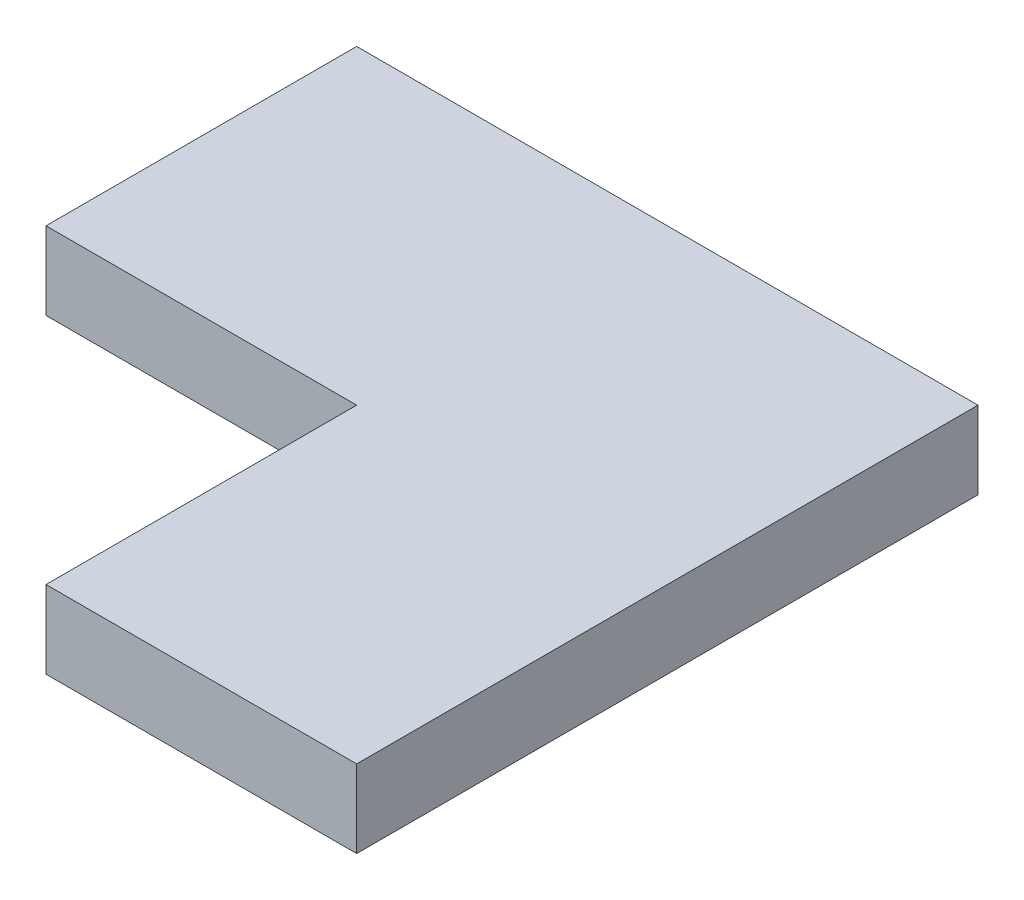
ISO-10303-21;
HEADER;
FILE_DESCRIPTION(('STEP AP214'),'2;1');
FILE_NAME('part.step','',(''),(''),'','','');
FILE_SCHEMA(('AUTOMOTIVE_DESIGN { 1 0 10303 214 1 1 1 1 }'));
ENDSEC;
DATA;
#1=APPLICATION_CONTEXT('core data for automotive mechanical design processes');
#2=APPLICATION_PROTOCOL_DEFINITION('international standard','automotive_design',2000,#1);
#3=PRODUCT_CONTEXT('',#1,'mechanical');
#4=PRODUCT('Part','Part','',(#3));
#5=PRODUCT_RELATED_PRODUCT_CATEGORY('part','',(#4));
#6=PRODUCT_DEFINITION_FORMATION('','',#4);
#7=PRODUCT_DEFINITION_CONTEXT('part definition',#1,'design');
#8=PRODUCT_DEFINITION('design','',#6,#7);
#9=PRODUCT_DEFINITION_SHAPE('','',#8);
#10=(LENGTH_UNIT() NAMED_UNIT(*) SI_UNIT(.MILLI.,.METRE.));
#11=(NAMED_UNIT(*) PLANE_ANGLE_UNIT() SI_UNIT($,.RADIAN.));
#12=(NAMED_UNIT(*) SI_UNIT($,.STERADIAN.) SOLID_ANGLE_UNIT());
#13=UNCERTAINTY_MEASURE_WITH_UNIT(LENGTH_MEASURE(1.E-05),#10,'distance_accuracy_value','');
#14=(GEOMETRIC_REPRESENTATION_CONTEXT(3) GLOBAL_UNCERTAINTY_ASSIGNED_CONTEXT((#13)) GLOBAL_UNIT_ASSIGNED_CONTEXT((#10,
#11,#12)) REPRESENTATION_CONTEXT('',''));
#15=CARTESIAN_POINT('',(0.,0.,0.));
#16=DIRECTION('',(0.,0.,1.));
#17=DIRECTION('',(1.,0.,0.));
#18=AXIS2_PLACEMENT_3D('',#15,#16,#17);
#19=CARTESIAN_POINT('',(100.,25.,0.));
#20=DIRECTION('',(1.,0.,0.));
#21=DIRECTION('',(0.,0.,-1.));
#22=AXIS2_PLACEMENT_3D('',#19,#20,#21);
#23=PLANE('',#22);
#24=DIRECTION('',(0.,0.,1.));
#25=VECTOR('',#24,1.);
#26=CARTESIAN_POINT('',(100.,0.,0.));
#27=LINE('',#26,#25);
#28=CARTESIAN_POINT('',(100.,0.,-50.));
#29=VERTEX_POINT('',#28);
#30=CARTESIAN_POINT('',(100.,0.,150.));
#31=VERTEX_POINT('',#30);
#32=EDGE_CURVE('E114',#29,#31,#27,.T.);
#33=ORIENTED_EDGE('',*,*,#32,.F.);
#34=DIRECTION('',(0.,-1.,0.));
#35=VECTOR('',#34,1.);
#36=CARTESIAN_POINT('',(100.,25.,-50.));
#37=LINE('',#36,#35);
#38=CARTESIAN_POINT('',(100.,25.,-50.));
#39=VERTEX_POINT('',#38);
#40=EDGE_CURVE('E11',#39,#29,#37,.T.);
#41=ORIENTED_EDGE('',*,*,#40,.F.);
#42=DIRECTION('',(0.,0.,1.));
#43=VECTOR('',#42,1.);
#44=CARTESIAN_POINT('',(100.,25.,0.));
#45=LINE('',#44,#43);
#46=CARTESIAN_POINT('',(100.,25.,150.));
#47=VERTEX_POINT('',#46);
#48=EDGE_CURVE('E126',#39,#47,#45,.T.);
#49=ORIENTED_EDGE('',*,*,#48,.T.);
#50=DIRECTION('',(0.,-1.,0.));
#51=VECTOR('',#50,1.);
#52=CARTESIAN_POINT('',(100.,25.,150.));
#53=LINE('',#52,#51);
#54=EDGE_CURVE('E78',#47,#31,#53,.T.);
#55=ORIENTED_EDGE('',*,*,#54,.T.);
#56=EDGE_LOOP('',(#33,#41,#49,#55));
#57=FACE_BOUND('',#56,.T.);
#58=ADVANCED_FACE('F33',(#57),#23,.T.);
#59=CARTESIAN_POINT('',(0.,25.,-50.));
#60=DIRECTION('',(0.,0.,-1.));
#61=DIRECTION('',(-1.,0.,0.));
#62=AXIS2_PLACEMENT_3D('',#59,#60,#61);
#63=PLANE('',#62);
#64=DIRECTION('',(1.,0.,0.));
#65=VECTOR('',#64,1.);
#66=CARTESIAN_POINT('',(0.,0.,-50.));
#67=LINE('',#66,#65);
#68=CARTESIAN_POINT('',(-100.,0.,-50.));
#69=VERTEX_POINT('',#68);
#70=EDGE_CURVE('E117',#69,#29,#67,.T.);
#71=ORIENTED_EDGE('',*,*,#70,.F.);
#72=DIRECTION('',(0.,-1.,0.));
#73=VECTOR('',#72,1.);
#74=CARTESIAN_POINT('',(-100.,25.,-50.));
#75=LINE('',#74,#73);
#76=CARTESIAN_POINT('',(-100.,25.,-50.));
#77=VERTEX_POINT('',#76);
#78=EDGE_CURVE('E41',#77,#69,#75,.T.);
#79=ORIENTED_EDGE('',*,*,#78,.F.);
#80=DIRECTION('',(1.,0.,0.));
#81=VECTOR('',#80,1.);
#82=CARTESIAN_POINT('',(0.,25.,-50.));
#83=LINE('',#82,#81);
#84=EDGE_CURVE('E138',#77,#39,#83,.T.);
#85=ORIENTED_EDGE('',*,*,#84,.T.);
#86=ORIENTED_EDGE('',*,*,#40,.T.);
#87=EDGE_LOOP('',(#71,#79,#85,#86));
#88=FACE_BOUND('',#87,.T.);
#89=ADVANCED_FACE('F137',(#88),#63,.T.);
#90=CARTESIAN_POINT('',(-100.,25.,0.));
#91=DIRECTION('',(1.,0.,0.));
#92=DIRECTION('',(0.,0.,-1.));
#93=AXIS2_PLACEMENT_3D('',#90,#91,#92);
#94=PLANE('',#93);
#95=DIRECTION('',(0.,0.,1.));
#96=VECTOR('',#95,1.);
#97=CARTESIAN_POINT('',(-100.,0.,0.));
#98=LINE('',#97,#96);
#99=CARTESIAN_POINT('',(-100.,0.,50.));
#100=VERTEX_POINT('',#99);
#101=EDGE_CURVE('E120',#69,#100,#98,.T.);
#102=ORIENTED_EDGE('',*,*,#101,.T.);
#103=DIRECTION('',(0.,-1.,0.));
#104=VECTOR('',#103,1.);
#105=CARTESIAN_POINT('',(-100.,25.,50.));
#106=LINE('',#105,#104);
#107=CARTESIAN_POINT('',(-100.,25.,50.));
#108=VERTEX_POINT('',#107);
#109=EDGE_CURVE('E106',#108,#100,#106,.T.);
#110=ORIENTED_EDGE('',*,*,#109,.F.);
#111=DIRECTION('',(0.,0.,1.));
#112=VECTOR('',#111,1.);
#113=CARTESIAN_POINT('',(-100.,25.,0.));
#114=LINE('',#113,#112);
#115=EDGE_CURVE('E97',#77,#108,#114,.T.);
#116=ORIENTED_EDGE('',*,*,#115,.F.);
#117=ORIENTED_EDGE('',*,*,#78,.T.);
#118=EDGE_LOOP('',(#102,#110,#116,#117));
#119=FACE_BOUND('',#118,.T.);
#120=ADVANCED_FACE('F131',(#119),#94,.F.);
#121=CARTESIAN_POINT('',(0.,25.,50.));
#122=DIRECTION('',(0.,0.,-1.));
#123=DIRECTION('',(-1.,0.,0.));
#124=AXIS2_PLACEMENT_3D('',#121,#122,#123);
#125=PLANE('',#124);
#126=DIRECTION('',(1.,0.,0.));
#127=VECTOR('',#126,1.);
#128=CARTESIAN_POINT('',(0.,0.,50.));
#129=LINE('',#128,#127);
#130=CARTESIAN_POINT('',(0.,0.,50.));
#131=VERTEX_POINT('',#130);
#132=EDGE_CURVE('E105',#100,#131,#129,.T.);
#133=ORIENTED_EDGE('',*,*,#132,.T.);
#134=DIRECTION('',(0.,-1.,0.));
#135=VECTOR('',#134,1.);
#136=CARTESIAN_POINT('',(0.,25.,50.));
#137=LINE('',#136,#135);
#138=CARTESIAN_POINT('',(0.,25.,50.));
#139=VERTEX_POINT('',#138);
#140=EDGE_CURVE('E102',#139,#131,#137,.T.);
#141=ORIENTED_EDGE('',*,*,#140,.F.);
#142=DIRECTION('',(1.,0.,0.));
#143=VECTOR('',#142,1.);
#144=CARTESIAN_POINT('',(0.,25.,50.));
#145=LINE('',#144,#143);
#146=EDGE_CURVE('E90',#108,#139,#145,.T.);
#147=ORIENTED_EDGE('',*,*,#146,.F.);
#148=ORIENTED_EDGE('',*,*,#109,.T.);
#149=EDGE_LOOP('',(#133,#141,#147,#148));
#150=FACE_BOUND('',#149,.T.);
#151=ADVANCED_FACE('F103',(#150),#125,.F.);
#152=CARTESIAN_POINT('',(0.,25.,0.));
#153=DIRECTION('',(1.,0.,0.));
#154=DIRECTION('',(0.,0.,-1.));
#155=AXIS2_PLACEMENT_3D('',#152,#153,#154);
#156=PLANE('',#155);
#157=DIRECTION('',(0.,0.,1.));
#158=VECTOR('',#157,1.);
#159=CARTESIAN_POINT('',(0.,0.,0.));
#160=LINE('',#159,#158);
#161=CARTESIAN_POINT('',(0.,0.,150.));
#162=VERTEX_POINT('',#161);
#163=EDGE_CURVE('E71',#131,#162,#160,.T.);
#164=ORIENTED_EDGE('',*,*,#163,.T.);
#165=DIRECTION('',(0.,-1.,0.));
#166=VECTOR('',#165,1.);
#167=CARTESIAN_POINT('',(0.,25.,150.));
#168=LINE('',#167,#166);
#169=CARTESIAN_POINT('',(0.,25.,150.));
#170=VERTEX_POINT('',#169);
#171=EDGE_CURVE('E107',#170,#162,#168,.T.);
#172=ORIENTED_EDGE('',*,*,#171,.F.);
#173=DIRECTION('',(0.,0.,1.));
#174=VECTOR('',#173,1.);
#175=CARTESIAN_POINT('',(0.,25.,0.));
#176=LINE('',#175,#174);
#177=EDGE_CURVE('E94',#139,#170,#176,.T.);
#178=ORIENTED_EDGE('',*,*,#177,.F.);
#179=ORIENTED_EDGE('',*,*,#140,.T.);
#180=EDGE_LOOP('',(#164,#172,#178,#179));
#181=FACE_BOUND('',#180,.T.);
#182=ADVANCED_FACE('F109',(#181),#156,.F.);
#183=CARTESIAN_POINT('',(0.,25.,150.));
#184=DIRECTION('',(0.,0.,-1.));
#185=DIRECTION('',(-1.,0.,0.));
#186=AXIS2_PLACEMENT_3D('',#183,#184,#185);
#187=PLANE('',#186);
#188=DIRECTION('',(1.,0.,0.));
#189=VECTOR('',#188,1.);
#190=CARTESIAN_POINT('',(0.,0.,150.));
#191=LINE('',#190,#189);
#192=EDGE_CURVE('E124',#162,#31,#191,.T.);
#193=ORIENTED_EDGE('',*,*,#192,.T.);
#194=ORIENTED_EDGE('',*,*,#54,.F.);
#195=DIRECTION('',(1.,0.,0.));
#196=VECTOR('',#195,1.);
#197=CARTESIAN_POINT('',(0.,25.,150.));
#198=LINE('',#197,#196);
#199=EDGE_CURVE('E49',#170,#47,#198,.T.);
#200=ORIENTED_EDGE('',*,*,#199,.F.);
#201=ORIENTED_EDGE('',*,*,#171,.T.);
#202=EDGE_LOOP('',(#193,#194,#200,#201));
#203=FACE_BOUND('',#202,.T.);
#204=ADVANCED_FACE('F141',(#203),#187,.F.);
#205=CARTESIAN_POINT('',(0.,25.,0.));
#206=DIRECTION('',(0.,1.,0.));
#207=DIRECTION('',(0.,0.,1.));
#208=AXIS2_PLACEMENT_3D('',#205,#206,#207);
#209=PLANE('',#208);
#210=ORIENTED_EDGE('',*,*,#48,.F.);
#211=ORIENTED_EDGE('',*,*,#84,.F.);
#212=ORIENTED_EDGE('',*,*,#115,.T.);
#213=ORIENTED_EDGE('',*,*,#146,.T.);
#214=ORIENTED_EDGE('',*,*,#177,.T.);
#215=ORIENTED_EDGE('',*,*,#199,.T.);
#216=EDGE_LOOP('',(#210,#211,#212,#213,#214,#215));
#217=FACE_BOUND('',#216,.T.);
#218=ADVANCED_FACE('F92',(#217),#209,.T.);
#219=CARTESIAN_POINT('',(0.,0.,0.));
#220=DIRECTION('',(0.,1.,0.));
#221=DIRECTION('',(0.,0.,1.));
#222=AXIS2_PLACEMENT_3D('',#219,#220,#221);
#223=PLANE('',#222);
#224=ORIENTED_EDGE('',*,*,#32,.T.);
#225=ORIENTED_EDGE('',*,*,#192,.F.);
#226=ORIENTED_EDGE('',*,*,#163,.F.);
#227=ORIENTED_EDGE('',*,*,#132,.F.);
#228=ORIENTED_EDGE('',*,*,#101,.F.);
#229=ORIENTED_EDGE('',*,*,#70,.T.);
#230=EDGE_LOOP('',(#224,#225,#226,#227,#228,#229));
#231=FACE_BOUND('',#230,.T.);
#232=ADVANCED_FACE('F136',(#231),#223,.F.);
#233=CLOSED_SHELL('',(#58,#89,#120,#151,#182,#204,#218,#232));
#234=MANIFOLD_SOLID_BREP('B2',#233);
#235=ADVANCED_BREP_SHAPE_REPRESENTATION('',(#18,#234),#14);
#236=SHAPE_DEFINITION_REPRESENTATION(#9,#235);
ENDSEC;
END-ISO-10303-21;
